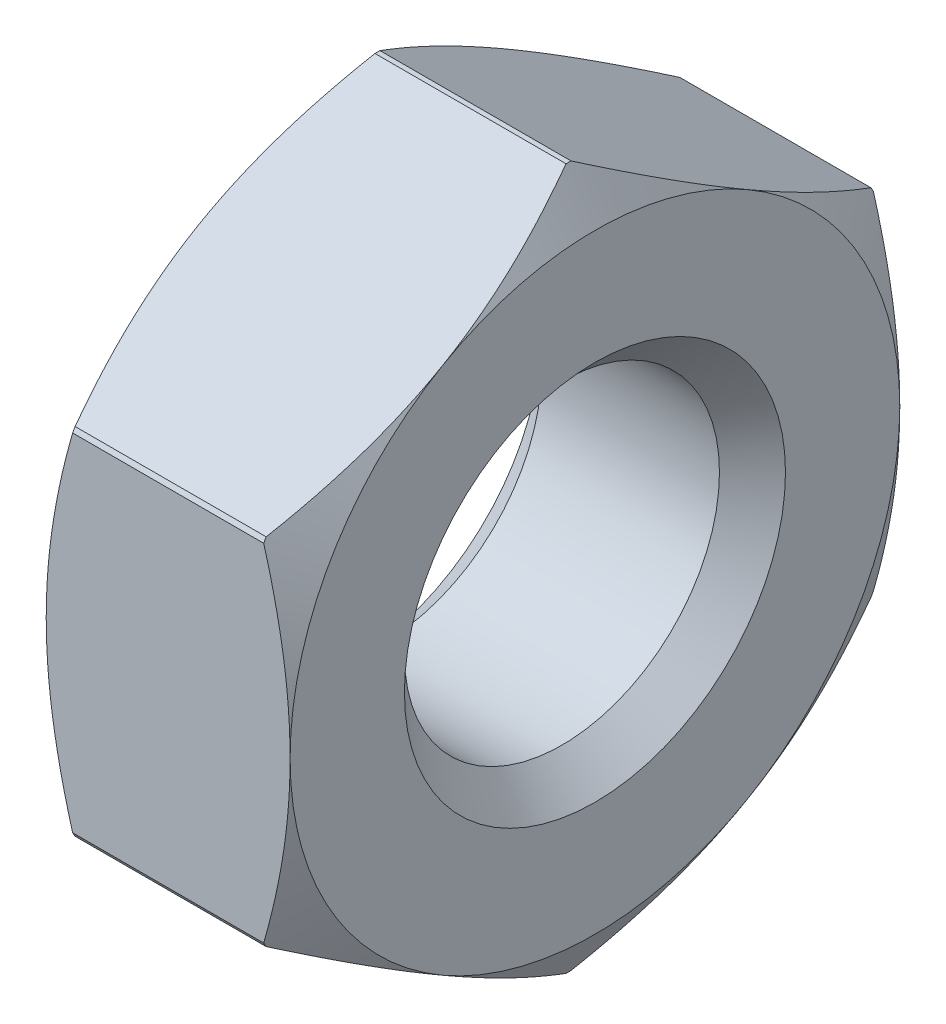
ISO-10303-21;
HEADER;
FILE_DESCRIPTION(('STEP AP214'),'2;1');
FILE_NAME('part.step','',(''),(''),'','','');
FILE_SCHEMA(('AUTOMOTIVE_DESIGN { 1 0 10303 214 1 1 1 1 }'));
ENDSEC;
DATA;
#1=APPLICATION_CONTEXT('core data for automotive mechanical design processes');
#2=APPLICATION_PROTOCOL_DEFINITION('international standard','automotive_design',2000,#1);
#3=PRODUCT_CONTEXT('',#1,'mechanical');
#4=PRODUCT('Part','Part','',(#3));
#5=PRODUCT_RELATED_PRODUCT_CATEGORY('part','',(#4));
#6=PRODUCT_DEFINITION_FORMATION('','',#4);
#7=PRODUCT_DEFINITION_CONTEXT('part definition',#1,'design');
#8=PRODUCT_DEFINITION('design','',#6,#7);
#9=PRODUCT_DEFINITION_SHAPE('','',#8);
#10=(LENGTH_UNIT() NAMED_UNIT(*) SI_UNIT(.MILLI.,.METRE.));
#11=(NAMED_UNIT(*) PLANE_ANGLE_UNIT() SI_UNIT($,.RADIAN.));
#12=(NAMED_UNIT(*) SI_UNIT($,.STERADIAN.) SOLID_ANGLE_UNIT());
#13=UNCERTAINTY_MEASURE_WITH_UNIT(LENGTH_MEASURE(1.E-05),#10,'distance_accuracy_value','');
#14=(GEOMETRIC_REPRESENTATION_CONTEXT(3) GLOBAL_UNCERTAINTY_ASSIGNED_CONTEXT((#13)) GLOBAL_UNIT_ASSIGNED_CONTEXT((#10,
#11,#12)) REPRESENTATION_CONTEXT('',''));
#15=CARTESIAN_POINT('',(0.,0.,0.));
#16=DIRECTION('',(0.,0.,1.));
#17=DIRECTION('',(1.,0.,0.));
#18=AXIS2_PLACEMENT_3D('',#15,#16,#17);
#19=CARTESIAN_POINT('',(-1.2535898384862,0.,0.));
#20=DIRECTION('',(1.,0.,0.));
#21=DIRECTION('',(0.,0.,-1.));
#22=AXIS2_PLACEMENT_3D('',#19,#20,#21);
#23=CONICAL_SURFACE('',#22,4.6,1.04719755119657);
#24=CARTESIAN_POINT('',(-1.2535898384862,0.,0.));
#25=DIRECTION('',(-1.,0.,0.));
#26=DIRECTION('',(0.,0.,1.));
#27=AXIS2_PLACEMENT_3D('',#24,#25,#26);
#28=CIRCLE('',#27,4.6);
#29=CARTESIAN_POINT('',(-1.2535898384862,2.27156333832011,4.));
#30=VERTEX_POINT('',#29);
#31=CARTESIAN_POINT('',(-1.2535898384862,2.3283199459777,3.9672315572906));
#32=VERTEX_POINT('',#31);
#33=EDGE_CURVE('E202',#30,#32,#28,.T.);
#34=ORIENTED_EDGE('',*,*,#33,.T.);
#35=CARTESIAN_POINT('',(-1.25338983848586,2.3279692402039,3.96783899750933));
#36=CARTESIAN_POINT('',(-1.31111735178797,2.429142168566,3.79260234523563));
#37=CARTESIAN_POINT('',(-1.36348279320894,2.53118892113824,3.61585218503312));
#38=CARTESIAN_POINT('',(-1.45457678399727,2.73702346022027,3.25933630539051));
#39=CARTESIAN_POINT('',(-1.49327364982772,2.84081471509825,3.07956457856053));
#40=CARTESIAN_POINT('',(-1.55308656588261,3.04712010513636,2.7222331611392));
#41=CARTESIAN_POINT('',(-1.57460784973854,3.14960377752827,2.54472623361016));
#42=CARTESIAN_POINT('',(-1.59956691269278,3.35501620732428,2.18894146869729));
#43=CARTESIAN_POINT('',(-1.60302614264184,3.45794429140324,2.01066479754682));
#44=CARTESIAN_POINT('',(-1.59246081058806,3.64780018158342,1.68182474963853));
#45=CARTESIAN_POINT('',(-1.58102948312847,3.73476734919332,1.53119319674782));
#46=CARTESIAN_POINT('',(-1.54582191519359,3.90813961339712,1.23090362652359));
#47=CARTESIAN_POINT('',(-1.52203530397381,3.99454417596539,1.08124653414958));
#48=CARTESIAN_POINT('',(-1.46297404311056,4.1682311172389,0.780411927252627));
#49=CARTESIAN_POINT('',(-1.42746612573347,4.25549316232234,0.629269631595747));
#50=CARTESIAN_POINT('',(-1.34703381000279,4.428767771581,0.3291492046981));
#51=CARTESIAN_POINT('',(-1.30212651130191,4.51478230551585,0.180167661733586));
#52=CARTESIAN_POINT('',(-1.2534092243396,4.6002,0.0322198750216415));
#53=B_SPLINE_CURVE_WITH_KNOTS('',3,(#35,#36,#37,#38,#39,#40,#41,#42,#43,#44,#45,#46,#47,#48,#49,
#50,#51,#52),.UNSPECIFIED.,.F.,.F.,(4,2,2,2,2,2,2,2,4),(0.,0.631503736039108,1.26446182692029,
1.88200396002549,2.49881252084838,3.02127973311479,3.54418620287518,4.07819884832956,
4.61124831605183),.UNSPECIFIED.);
#54=CARTESIAN_POINT('',(-1.6,3.46410161513775,2.));
#55=VERTEX_POINT('',#54);
#56=EDGE_CURVE('E326',#32,#55,#53,.T.);
#57=ORIENTED_EDGE('',*,*,#56,.T.);
#58=CARTESIAN_POINT('',(-1.6,0.,0.));
#59=DIRECTION('',(-1.,0.,0.));
#60=DIRECTION('',(0.,0.,1.));
#61=AXIS2_PLACEMENT_3D('',#58,#59,#60);
#62=CIRCLE('',#61,4.);
#63=CARTESIAN_POINT('',(-1.6,0.,4.));
#64=VERTEX_POINT('',#63);
#65=EDGE_CURVE('E197',#64,#55,#62,.T.);
#66=ORIENTED_EDGE('',*,*,#65,.F.);
#67=CARTESIAN_POINT('',(0.313379078741315,-6.1233664535977,4.));
#68=CARTESIAN_POINT('',(0.228520444207372,-5.94775555210065,4.));
#69=CARTESIAN_POINT('',(0.14450583630976,-5.77172927793175,4.));
#70=CARTESIAN_POINT('',(-0.0213529852084576,-5.41862138471516,4.));
#71=CARTESIAN_POINT('',(-0.103196822694453,-5.24153958920135,4.));
#72=CARTESIAN_POINT('',(-0.264663248796663,-4.88513872870433,4.));
#73=CARTESIAN_POINT('',(-0.344270431676537,-4.70581265888233,4.));
#74=CARTESIAN_POINT('',(-0.500063305946178,-4.34568605973509,4.));
#75=CARTESIAN_POINT('',(-0.576249175810661,-4.16488560790455,4.));
#76=CARTESIAN_POINT('',(-0.725191190367983,-3.79928520033142,4.));
#77=CARTESIAN_POINT('',(-0.797893952066102,-3.61446337687946,4.));
#78=CARTESIAN_POINT('',(-0.937601649527753,-3.24263920484199,4.));
#79=CARTESIAN_POINT('',(-1.00460595118251,-3.05563661621294,4.));
#80=CARTESIAN_POINT('',(-1.13111524111974,-2.67953798881603,4.));
#81=CARTESIAN_POINT('',(-1.19063618601766,-2.49044737285613,4.));
#82=CARTESIAN_POINT('',(-1.30024474002198,-2.10957804366364,4.));
#83=CARTESIAN_POINT('',(-1.35033533382433,-1.91780020165196,4.));
#84=CARTESIAN_POINT('',(-1.43865061155497,-1.53142481889712,4.));
#85=CARTESIAN_POINT('',(-1.47687205590236,-1.33682652347865,4.));
#86=CARTESIAN_POINT('',(-1.5388743003406,-0.945285434361876,4.));
#87=CARTESIAN_POINT('',(-1.56265508599781,-0.748342638320415,4.));
#88=CARTESIAN_POINT('',(-1.59367220542207,-0.354389260897205,4.));
#89=CARTESIAN_POINT('',(-1.60101312112597,-0.157387127838942,4.));
#90=CARTESIAN_POINT('',(-1.59876117115889,0.236476698325858,4.));
#91=CARTESIAN_POINT('',(-1.58917269339217,0.433338414597014,4.));
#92=CARTESIAN_POINT('',(-1.55901327204393,0.769555733364206,4.));
#93=CARTESIAN_POINT('',(-1.54235959607666,0.909282368357053,4.));
#94=CARTESIAN_POINT('',(-1.50160756903169,1.18765527874236,4.));
#95=CARTESIAN_POINT('',(-1.47750804257503,1.32630138001999,4.));
#96=CARTESIAN_POINT('',(-1.39530560781012,1.74050640575306,4.));
#97=CARTESIAN_POINT('',(-1.32732004295461,2.01412264026251,4.));
#98=CARTESIAN_POINT('',(-1.21007611546408,2.42354479344988,4.));
#99=CARTESIAN_POINT('',(-1.16785336132348,2.56148513959008,4.));
#100=CARTESIAN_POINT('',(-1.07923308673662,2.83592606637809,4.));
#101=CARTESIAN_POINT('',(-1.03283844697141,2.97242756888127,4.));
#102=CARTESIAN_POINT('',(-0.936839537899242,3.24341998247051,4.));
#103=CARTESIAN_POINT('',(-0.887254810051087,3.37791788659785,4.));
#104=CARTESIAN_POINT('',(-0.785177071056811,3.6458704440832,4.));
#105=CARTESIAN_POINT('',(-0.732682883212017,3.77932465005986,4.));
#106=CARTESIAN_POINT('',(-0.679021142388919,3.91229645619189,4.));
#107=B_SPLINE_CURVE_WITH_KNOTS('',3,(#67,#68,#69,#70,#71,#72,#73,#74,#75,#76,#77,#78,#79,#80,
#81,#82,#83,#84,#85,#86,#87,#88,#89,#90,#91,#92,#93,#94,#95,#96,#97,#98,#99,#100,#101,#102,#103,
#104,#105,#106),.UNSPECIFIED.,.F.,.F.,(4,2,2,2,2,2,2,2,2,2,2,2,2,2,2,2,2,2,2,4),(0.,
0.585124594132892,1.17034992050025,1.75892688540866,2.34747311111829,2.94322193926471,
3.53903697417808,4.13355920436511,4.72789295140857,5.32238877437791,5.91688519155342,
6.50758885642441,7.09813944016759,7.52008013875713,7.94208747766234,8.78673076285676,
9.21946972878956,9.65191215053146,10.0819198428512,10.5121027343793),.UNSPECIFIED.);
#108=EDGE_CURVE('E267',#64,#30,#107,.T.);
#109=ORIENTED_EDGE('',*,*,#108,.T.);
#110=EDGE_LOOP('',(#34,#57,#66,#109));
#111=FACE_BOUND('',#110,.T.);
#112=ADVANCED_FACE('F31',(#111),#23,.T.);
#113=CARTESIAN_POINT('',(-1.2535898384862,-2.3283199459777,3.9672315572906));
#114=VERTEX_POINT('',#113);
#115=CARTESIAN_POINT('',(-1.2535898384862,-2.27156333832011,4.));
#116=VERTEX_POINT('',#115);
#117=EDGE_CURVE('E330',#114,#116,#28,.T.);
#118=ORIENTED_EDGE('',*,*,#117,.T.);
#119=EDGE_CURVE('E275',#116,#64,#107,.T.);
#120=ORIENTED_EDGE('',*,*,#119,.T.);
#121=CARTESIAN_POINT('',(-1.6,-3.46410161513775,2.));
#122=VERTEX_POINT('',#121);
#123=EDGE_CURVE('E199',#122,#64,#62,.T.);
#124=ORIENTED_EDGE('',*,*,#123,.F.);
#125=CARTESIAN_POINT('',(-1.2534092243396,-4.6002,0.0322198750216419));
#126=CARTESIAN_POINT('',(-1.31113513524419,-4.49902761515883,0.207455585889462));
#127=CARTESIAN_POINT('',(-1.36349887129164,-4.39698141014375,0.384204797695172));
#128=CARTESIAN_POINT('',(-1.45458931866139,-4.19114802077275,0.740718685979847));
#129=CARTESIAN_POINT('',(-1.49328434835822,-4.0873573683737,0.920489369285726));
#130=CARTESIAN_POINT('',(-1.55309361407995,-3.88105320756823,1.27781865761365));
#131=CARTESIAN_POINT('',(-1.57461308026609,-3.77857016001243,1.4553245028948));
#132=CARTESIAN_POINT('',(-1.59956864459734,-3.57315905408983,1.81110697479165));
#133=CARTESIAN_POINT('',(-1.60302619245385,-3.47023166892176,1.98938243539296));
#134=CARTESIAN_POINT('',(-1.59245796307569,-3.28037581092052,2.3182224275657));
#135=CARTESIAN_POINT('',(-1.58102517746005,-3.19340797030735,2.46885514613226));
#136=CARTESIAN_POINT('',(-1.54581462012315,-3.02003441169075,2.76914695834524));
#137=CARTESIAN_POINT('',(-1.52202647740764,-2.93362922776767,2.91880512693733));
#138=CARTESIAN_POINT('',(-1.46296213616868,-2.75994105654835,3.21964186416292));
#139=CARTESIAN_POINT('',(-1.42745266840009,-2.67267840391389,3.37078521212904));
#140=CARTESIAN_POINT('',(-1.34701732333292,-2.49940261277033,3.67090768611138));
#141=CARTESIAN_POINT('',(-1.30210854622023,-2.41338750437934,3.81989022406313));
#142=CARTESIAN_POINT('',(-1.25338983848586,-2.3279692402039,3.96783899750933));
#143=B_SPLINE_CURVE_WITH_KNOTS('',3,(#125,#126,#127,#128,#129,#130,#131,#132,#133,#134,#135,
#136,#137,#138,#139,#140,#141,#142),.UNSPECIFIED.,.F.,.F.,(4,2,2,2,2,2,2,2,4),(0.,
0.631499273935331,1.26445279196895,1.88199062592049,2.49879492624227,3.0212664480065,
3.54417723891331,4.0781943887806,4.61124831603214),.UNSPECIFIED.);
#144=EDGE_CURVE('E259',#122,#114,#143,.T.);
#145=ORIENTED_EDGE('',*,*,#144,.T.);
#146=EDGE_LOOP('',(#118,#120,#124,#145));
#147=FACE_BOUND('',#146,.T.);
#148=ADVANCED_FACE('F316',(#147),#23,.T.);
#149=CARTESIAN_POINT('',(-1.2535898384862,-4.59988328429781,-0.0327684427093903));
#150=VERTEX_POINT('',#149);
#151=CARTESIAN_POINT('',(-1.2535898384862,-4.59988328429781,0.0327684427093903));
#152=VERTEX_POINT('',#151);
#153=EDGE_CURVE('E334',#150,#152,#28,.T.);
#154=ORIENTED_EDGE('',*,*,#153,.T.);
#155=EDGE_CURVE('E401',#152,#122,#143,.T.);
#156=ORIENTED_EDGE('',*,*,#155,.T.);
#157=CARTESIAN_POINT('',(-1.6,-3.46410161513775,-2.));
#158=VERTEX_POINT('',#157);
#159=EDGE_CURVE('E331',#158,#122,#62,.T.);
#160=ORIENTED_EDGE('',*,*,#159,.F.);
#161=CARTESIAN_POINT('',(-1.25338983848586,-2.3279692402039,-3.96783899750933));
#162=CARTESIAN_POINT('',(-1.31111735178797,-2.429142168566,-3.79260234523563));
#163=CARTESIAN_POINT('',(-1.36348279320894,-2.53118892113824,-3.61585218503312));
#164=CARTESIAN_POINT('',(-1.45457678399727,-2.73702346022027,-3.25933630539051));
#165=CARTESIAN_POINT('',(-1.49327364982772,-2.84081471509825,-3.07956457856053));
#166=CARTESIAN_POINT('',(-1.55308656588261,-3.04712010513636,-2.7222331611392));
#167=CARTESIAN_POINT('',(-1.57460784973854,-3.14960377752827,-2.54472623361016));
#168=CARTESIAN_POINT('',(-1.59956691269278,-3.35501620732428,-2.18894146869729));
#169=CARTESIAN_POINT('',(-1.60302614264184,-3.45794429140324,-2.01066479754682));
#170=CARTESIAN_POINT('',(-1.59246081058806,-3.64780018158342,-1.68182474963853));
#171=CARTESIAN_POINT('',(-1.58102948312847,-3.73476734919332,-1.53119319674782));
#172=CARTESIAN_POINT('',(-1.54582191519359,-3.90813961339712,-1.23090362652359));
#173=CARTESIAN_POINT('',(-1.52203530397381,-3.99454417596539,-1.08124653414958));
#174=CARTESIAN_POINT('',(-1.46297404311056,-4.1682311172389,-0.780411927252627));
#175=CARTESIAN_POINT('',(-1.42746612573347,-4.25549316232234,-0.629269631595747));
#176=CARTESIAN_POINT('',(-1.34703381000279,-4.428767771581,-0.3291492046981));
#177=CARTESIAN_POINT('',(-1.30212651130191,-4.51478230551585,-0.180167661733586));
#178=CARTESIAN_POINT('',(-1.2534092243396,-4.6002,-0.0322198750216415));
#179=B_SPLINE_CURVE_WITH_KNOTS('',3,(#161,#162,#163,#164,#165,#166,#167,#168,#169,#170,#171,
#172,#173,#174,#175,#176,#177,#178),.UNSPECIFIED.,.F.,.F.,(4,2,2,2,2,2,2,2,4),(0.,
0.631503736039108,1.26446182692029,1.88200396002549,2.49881252084838,3.02127973311479,
3.54418620287518,4.07819884832956,4.61124831605183),.UNSPECIFIED.);
#180=EDGE_CURVE('E252',#158,#150,#179,.T.);
#181=ORIENTED_EDGE('',*,*,#180,.T.);
#182=EDGE_LOOP('',(#154,#156,#160,#181));
#183=FACE_BOUND('',#182,.T.);
#184=ADVANCED_FACE('F321',(#183),#23,.T.);
#185=CARTESIAN_POINT('',(-1.2535898384862,-2.27156333832011,-4.));
#186=VERTEX_POINT('',#185);
#187=CARTESIAN_POINT('',(-1.2535898384862,-2.3283199459777,-3.9672315572906));
#188=VERTEX_POINT('',#187);
#189=EDGE_CURVE('E340',#186,#188,#28,.T.);
#190=ORIENTED_EDGE('',*,*,#189,.T.);
#191=EDGE_CURVE('E405',#188,#158,#179,.T.);
#192=ORIENTED_EDGE('',*,*,#191,.T.);
#193=CARTESIAN_POINT('',(-1.6,0.,-4.));
#194=VERTEX_POINT('',#193);
#195=EDGE_CURVE('E192',#194,#158,#62,.T.);
#196=ORIENTED_EDGE('',*,*,#195,.F.);
#197=CARTESIAN_POINT('',(0.313379078741315,-6.1233664535977,-4.));
#198=CARTESIAN_POINT('',(0.228520444207372,-5.94775555210065,-4.));
#199=CARTESIAN_POINT('',(0.14450583630976,-5.77172927793175,-4.));
#200=CARTESIAN_POINT('',(-0.0213529852084576,-5.41862138471516,-4.));
#201=CARTESIAN_POINT('',(-0.103196822694453,-5.24153958920135,-4.));
#202=CARTESIAN_POINT('',(-0.264663248796663,-4.88513872870433,-4.));
#203=CARTESIAN_POINT('',(-0.344270431676537,-4.70581265888233,-4.));
#204=CARTESIAN_POINT('',(-0.500063305946178,-4.34568605973509,-4.));
#205=CARTESIAN_POINT('',(-0.576249175810661,-4.16488560790455,-4.));
#206=CARTESIAN_POINT('',(-0.725191190367983,-3.79928520033142,-4.));
#207=CARTESIAN_POINT('',(-0.797893952066102,-3.61446337687946,-4.));
#208=CARTESIAN_POINT('',(-0.937601649527753,-3.24263920484199,-4.));
#209=CARTESIAN_POINT('',(-1.00460595118251,-3.05563661621294,-4.));
#210=CARTESIAN_POINT('',(-1.13111524111974,-2.67953798881603,-4.));
#211=CARTESIAN_POINT('',(-1.19063618601766,-2.49044737285613,-4.));
#212=CARTESIAN_POINT('',(-1.30024474002198,-2.10957804366364,-4.));
#213=CARTESIAN_POINT('',(-1.35033533382433,-1.91780020165196,-4.));
#214=CARTESIAN_POINT('',(-1.43865061155497,-1.53142481889712,-4.));
#215=CARTESIAN_POINT('',(-1.47687205590236,-1.33682652347865,-4.));
#216=CARTESIAN_POINT('',(-1.5388743003406,-0.945285434361876,-4.));
#217=CARTESIAN_POINT('',(-1.56265508599781,-0.748342638320415,-4.));
#218=CARTESIAN_POINT('',(-1.59367220542207,-0.354389260897205,-4.));
#219=CARTESIAN_POINT('',(-1.60101312112597,-0.157387127838942,-4.));
#220=CARTESIAN_POINT('',(-1.59876117115889,0.236476698325858,-4.));
#221=CARTESIAN_POINT('',(-1.58917269339217,0.433338414597014,-4.));
#222=CARTESIAN_POINT('',(-1.55901327204393,0.769555733364206,-4.));
#223=CARTESIAN_POINT('',(-1.54235959607666,0.909282368357053,-4.));
#224=CARTESIAN_POINT('',(-1.50160756903169,1.18765527874236,-4.));
#225=CARTESIAN_POINT('',(-1.47750804257503,1.32630138001999,-4.));
#226=CARTESIAN_POINT('',(-1.39530560781012,1.74050640575306,-4.));
#227=CARTESIAN_POINT('',(-1.32732004295461,2.01412264026251,-4.));
#228=CARTESIAN_POINT('',(-1.21007611546408,2.42354479344988,-4.));
#229=CARTESIAN_POINT('',(-1.16785336132348,2.56148513959008,-4.));
#230=CARTESIAN_POINT('',(-1.07923308673662,2.83592606637809,-4.));
#231=CARTESIAN_POINT('',(-1.03283844697141,2.97242756888127,-4.));
#232=CARTESIAN_POINT('',(-0.936839537899242,3.24341998247051,-4.));
#233=CARTESIAN_POINT('',(-0.887254810051087,3.37791788659785,-4.));
#234=CARTESIAN_POINT('',(-0.785177071056811,3.6458704440832,-4.));
#235=CARTESIAN_POINT('',(-0.732682883212017,3.77932465005986,-4.));
#236=CARTESIAN_POINT('',(-0.679021142388919,3.91229645619189,-4.));
#237=B_SPLINE_CURVE_WITH_KNOTS('',3,(#197,#198,#199,#200,#201,#202,#203,#204,#205,#206,#207,
#208,#209,#210,#211,#212,#213,#214,#215,#216,#217,#218,#219,#220,#221,#222,#223,#224,#225,#226,
#227,#228,#229,#230,#231,#232,#233,#234,#235,#236),.UNSPECIFIED.,.F.,.F.,(4,2,2,2,2,2,2,2,2,2,2,
2,2,2,2,2,2,2,2,4),(0.,0.585124594132892,1.17034992050025,1.75892688540866,2.34747311111829,
2.94322193926471,3.53903697417808,4.13355920436511,4.72789295140857,5.32238877437791,
5.91688519155342,6.50758885642441,7.09813944016759,7.52008013875713,7.94208747766234,
8.78673076285676,9.21946972878956,9.65191215053146,10.0819198428512,10.5121027343793),.UNSPECIFIED.);
#238=EDGE_CURVE('E245',#194,#186,#237,.F.);
#239=ORIENTED_EDGE('',*,*,#238,.T.);
#240=EDGE_LOOP('',(#190,#192,#196,#239));
#241=FACE_BOUND('',#240,.T.);
#242=ADVANCED_FACE('F458',(#241),#23,.T.);
#243=CARTESIAN_POINT('',(-1.2535898384862,2.3283199459777,-3.9672315572906));
#244=VERTEX_POINT('',#243);
#245=CARTESIAN_POINT('',(-1.2535898384862,2.27156333832011,-4.));
#246=VERTEX_POINT('',#245);
#247=EDGE_CURVE('E332',#244,#246,#28,.T.);
#248=ORIENTED_EDGE('',*,*,#247,.T.);
#249=EDGE_CURVE('E188',#246,#194,#237,.F.);
#250=ORIENTED_EDGE('',*,*,#249,.T.);
#251=CARTESIAN_POINT('',(-1.6,3.46410161513775,-2.));
#252=VERTEX_POINT('',#251);
#253=EDGE_CURVE('E186',#252,#194,#62,.T.);
#254=ORIENTED_EDGE('',*,*,#253,.F.);
#255=CARTESIAN_POINT('',(-1.2534092243396,4.6002,-0.0322198750216419));
#256=CARTESIAN_POINT('',(-1.31113513524419,4.49902761515883,-0.207455585889462));
#257=CARTESIAN_POINT('',(-1.36349887129164,4.39698141014375,-0.384204797695172));
#258=CARTESIAN_POINT('',(-1.45458931866139,4.19114802077275,-0.740718685979847));
#259=CARTESIAN_POINT('',(-1.49328434835822,4.0873573683737,-0.920489369285726));
#260=CARTESIAN_POINT('',(-1.55309361407995,3.88105320756823,-1.27781865761365));
#261=CARTESIAN_POINT('',(-1.57461308026609,3.77857016001243,-1.4553245028948));
#262=CARTESIAN_POINT('',(-1.59956864459734,3.57315905408983,-1.81110697479165));
#263=CARTESIAN_POINT('',(-1.60302619245385,3.47023166892176,-1.98938243539296));
#264=CARTESIAN_POINT('',(-1.59245796307569,3.28037581092052,-2.3182224275657));
#265=CARTESIAN_POINT('',(-1.58102517746005,3.19340797030735,-2.46885514613226));
#266=CARTESIAN_POINT('',(-1.54581462012315,3.02003441169075,-2.76914695834524));
#267=CARTESIAN_POINT('',(-1.52202647740764,2.93362922776767,-2.91880512693733));
#268=CARTESIAN_POINT('',(-1.46296213616868,2.75994105654835,-3.21964186416292));
#269=CARTESIAN_POINT('',(-1.42745266840009,2.67267840391389,-3.37078521212904));
#270=CARTESIAN_POINT('',(-1.34701732333292,2.49940261277033,-3.67090768611138));
#271=CARTESIAN_POINT('',(-1.30210854622023,2.41338750437934,-3.81989022406313));
#272=CARTESIAN_POINT('',(-1.25338983848586,2.3279692402039,-3.96783899750933));
#273=B_SPLINE_CURVE_WITH_KNOTS('',3,(#255,#256,#257,#258,#259,#260,#261,#262,#263,#264,#265,
#266,#267,#268,#269,#270,#271,#272),.UNSPECIFIED.,.F.,.F.,(4,2,2,2,2,2,2,2,4),(0.,
0.631499273935331,1.26445279196895,1.88199062592049,2.49879492624227,3.0212664480065,
3.54417723891331,4.0781943887806,4.61124831603214),.UNSPECIFIED.);
#274=EDGE_CURVE('E160',#252,#244,#273,.T.);
#275=ORIENTED_EDGE('',*,*,#274,.T.);
#276=EDGE_LOOP('',(#248,#250,#254,#275));
#277=FACE_BOUND('',#276,.T.);
#278=ADVANCED_FACE('F187',(#277),#23,.T.);
#279=CARTESIAN_POINT('',(1.6,0.,0.));
#280=DIRECTION('',(-1.,0.,0.));
#281=DIRECTION('',(0.,0.,1.));
#282=AXIS2_PLACEMENT_3D('',#279,#280,#281);
#283=CYLINDRICAL_SURFACE('',#282,4.6);
#284=CARTESIAN_POINT('',(1.2535898384862,0.,0.));
#285=DIRECTION('',(-1.,0.,0.));
#286=DIRECTION('',(0.,0.,1.));
#287=AXIS2_PLACEMENT_3D('',#284,#285,#286);
#288=CIRCLE('',#287,4.6);
#289=CARTESIAN_POINT('',(1.2535898384862,2.27156333832011,4.));
#290=VERTEX_POINT('',#289);
#291=CARTESIAN_POINT('',(1.2535898384862,2.3283199459777,3.9672315572906));
#292=VERTEX_POINT('',#291);
#293=EDGE_CURVE('E335',#290,#292,#288,.T.);
#294=ORIENTED_EDGE('',*,*,#293,.T.);
#295=DIRECTION('',(-1.,0.,0.));
#296=VECTOR('',#295,1.);
#297=CARTESIAN_POINT('',(1.6,2.3283199459777,3.9672315572906));
#298=LINE('',#297,#296);
#299=EDGE_CURVE('E390',#292,#32,#298,.T.);
#300=ORIENTED_EDGE('',*,*,#299,.T.);
#301=ORIENTED_EDGE('',*,*,#33,.F.);
#302=DIRECTION('',(-1.,0.,0.));
#303=VECTOR('',#302,1.);
#304=CARTESIAN_POINT('',(1.6,2.27156333832011,4.));
#305=LINE('',#304,#303);
#306=EDGE_CURVE('E402',#30,#290,#305,.F.);
#307=ORIENTED_EDGE('',*,*,#306,.T.);
#308=EDGE_LOOP('',(#294,#300,#301,#307));
#309=FACE_BOUND('',#308,.T.);
#310=ADVANCED_FACE('F451',(#309),#283,.T.);
#311=CARTESIAN_POINT('',(1.2535898384862,-2.3283199459777,3.9672315572906));
#312=VERTEX_POINT('',#311);
#313=CARTESIAN_POINT('',(1.2535898384862,-2.27156333832011,4.));
#314=VERTEX_POINT('',#313);
#315=EDGE_CURVE('E343',#312,#314,#288,.T.);
#316=ORIENTED_EDGE('',*,*,#315,.T.);
#317=DIRECTION('',(-1.,0.,0.));
#318=VECTOR('',#317,1.);
#319=CARTESIAN_POINT('',(1.6,-2.27156333832011,4.));
#320=LINE('',#319,#318);
#321=EDGE_CURVE('E51',#314,#116,#320,.T.);
#322=ORIENTED_EDGE('',*,*,#321,.T.);
#323=ORIENTED_EDGE('',*,*,#117,.F.);
#324=DIRECTION('',(-1.,0.,0.));
#325=VECTOR('',#324,1.);
#326=CARTESIAN_POINT('',(1.6,-2.3283199459777,3.9672315572906));
#327=LINE('',#326,#325);
#328=EDGE_CURVE('E403',#114,#312,#327,.F.);
#329=ORIENTED_EDGE('',*,*,#328,.T.);
#330=EDGE_LOOP('',(#316,#322,#323,#329));
#331=FACE_BOUND('',#330,.T.);
#332=ADVANCED_FACE('F446',(#331),#283,.T.);
#333=CARTESIAN_POINT('',(1.2535898384862,-4.59988328429781,-0.0327684427093902));
#334=VERTEX_POINT('',#333);
#335=CARTESIAN_POINT('',(1.2535898384862,-4.59988328429781,0.0327684427093903));
#336=VERTEX_POINT('',#335);
#337=EDGE_CURVE('E349',#334,#336,#288,.T.);
#338=ORIENTED_EDGE('',*,*,#337,.T.);
#339=DIRECTION('',(-1.,0.,0.));
#340=VECTOR('',#339,1.);
#341=CARTESIAN_POINT('',(1.6,-4.59988328429781,0.0327684427093903));
#342=LINE('',#341,#340);
#343=EDGE_CURVE('E59',#336,#152,#342,.T.);
#344=ORIENTED_EDGE('',*,*,#343,.T.);
#345=ORIENTED_EDGE('',*,*,#153,.F.);
#346=DIRECTION('',(-1.,0.,0.));
#347=VECTOR('',#346,1.);
#348=CARTESIAN_POINT('',(1.6,-4.59988328429781,-0.0327684427093903));
#349=LINE('',#348,#347);
#350=EDGE_CURVE('E411',#150,#334,#349,.F.);
#351=ORIENTED_EDGE('',*,*,#350,.T.);
#352=EDGE_LOOP('',(#338,#344,#345,#351));
#353=FACE_BOUND('',#352,.T.);
#354=ADVANCED_FACE('F444',(#353),#283,.T.);
#355=CARTESIAN_POINT('',(1.25358983848685,-2.27156333832106,-4.));
#356=VERTEX_POINT('',#355);
#357=CARTESIAN_POINT('',(1.2535898384862,-2.3283199459777,-3.9672315572906));
#358=VERTEX_POINT('',#357);
#359=EDGE_CURVE('E355',#356,#358,#288,.T.);
#360=ORIENTED_EDGE('',*,*,#359,.T.);
#361=DIRECTION('',(-1.,0.,0.));
#362=VECTOR('',#361,1.);
#363=CARTESIAN_POINT('',(1.6,-2.3283199459777,-3.9672315572906));
#364=LINE('',#363,#362);
#365=EDGE_CURVE('E409',#358,#188,#364,.T.);
#366=ORIENTED_EDGE('',*,*,#365,.T.);
#367=ORIENTED_EDGE('',*,*,#189,.F.);
#368=DIRECTION('',(-1.,0.,0.));
#369=VECTOR('',#368,1.);
#370=CARTESIAN_POINT('',(1.6,-2.27156333832011,-4.));
#371=LINE('',#370,#369);
#372=EDGE_CURVE('E183',#186,#356,#371,.F.);
#373=ORIENTED_EDGE('',*,*,#372,.T.);
#374=EDGE_LOOP('',(#360,#366,#367,#373));
#375=FACE_BOUND('',#374,.T.);
#376=ADVANCED_FACE('F424',(#375),#283,.T.);
#377=CARTESIAN_POINT('',(1.2535898384862,2.3283199459777,-3.9672315572906));
#378=VERTEX_POINT('',#377);
#379=CARTESIAN_POINT('',(1.2535898384862,2.27156333832011,-4.));
#380=VERTEX_POINT('',#379);
#381=EDGE_CURVE('E346',#378,#380,#288,.T.);
#382=ORIENTED_EDGE('',*,*,#381,.T.);
#383=DIRECTION('',(-1.,0.,0.));
#384=VECTOR('',#383,1.);
#385=CARTESIAN_POINT('',(1.6,2.27156333832011,-4.));
#386=LINE('',#385,#384);
#387=EDGE_CURVE('E418',#380,#246,#386,.T.);
#388=ORIENTED_EDGE('',*,*,#387,.T.);
#389=ORIENTED_EDGE('',*,*,#247,.F.);
#390=DIRECTION('',(-1.,0.,0.));
#391=VECTOR('',#390,1.);
#392=CARTESIAN_POINT('',(1.6,2.3283199459777,-3.9672315572906));
#393=LINE('',#392,#391);
#394=EDGE_CURVE('E166',#244,#378,#393,.F.);
#395=ORIENTED_EDGE('',*,*,#394,.T.);
#396=EDGE_LOOP('',(#382,#388,#389,#395));
#397=FACE_BOUND('',#396,.T.);
#398=ADVANCED_FACE('F431',(#397),#283,.T.);
#399=CARTESIAN_POINT('',(1.6,0.,0.));
#400=DIRECTION('',(-1.,0.,0.));
#401=DIRECTION('',(0.,0.,1.));
#402=AXIS2_PLACEMENT_3D('',#399,#400,#401);
#403=CONICAL_SURFACE('',#402,4.,1.04719755119657);
#404=CARTESIAN_POINT('',(1.2535898384862,4.59988328429781,0.0327684427093902));
#405=VERTEX_POINT('',#404);
#406=CARTESIAN_POINT('',(1.2535898384862,4.59988328429781,-0.0327684427093903));
#407=VERTEX_POINT('',#406);
#408=EDGE_CURVE('E342',#405,#407,#288,.T.);
#409=ORIENTED_EDGE('',*,*,#408,.F.);
#410=CARTESIAN_POINT('',(1.2534092243396,4.6002,0.0322198750216413));
#411=CARTESIAN_POINT('',(1.31113513524419,4.49902761515883,0.207455585889462));
#412=CARTESIAN_POINT('',(1.36349887129164,4.39698141014375,0.384204797695171));
#413=CARTESIAN_POINT('',(1.45458931866138,4.19114802077275,0.740718685979846));
#414=CARTESIAN_POINT('',(1.49328434835822,4.0873573683737,0.920489369285725));
#415=CARTESIAN_POINT('',(1.55309361407995,3.88105320756823,1.27781865761365));
#416=CARTESIAN_POINT('',(1.57461308026609,3.77857016001243,1.4553245028948));
#417=CARTESIAN_POINT('',(1.59956864459734,3.57315905408984,1.81110697479165));
#418=CARTESIAN_POINT('',(1.60302619245385,3.47023166892176,1.98938243539296));
#419=CARTESIAN_POINT('',(1.59245796307569,3.28037581092052,2.3182224275657));
#420=CARTESIAN_POINT('',(1.58102517746005,3.19340797030735,2.46885514613226));
#421=CARTESIAN_POINT('',(1.54581462012315,3.02003441169075,2.76914695834523));
#422=CARTESIAN_POINT('',(1.52202647740764,2.93362922776768,2.91880512693733));
#423=CARTESIAN_POINT('',(1.46296213616868,2.75994105654835,3.21964186416292));
#424=CARTESIAN_POINT('',(1.42745266840009,2.67267840391389,3.37078521212904));
#425=CARTESIAN_POINT('',(1.34701732333292,2.49940261277033,3.67090768611138));
#426=CARTESIAN_POINT('',(1.30210854622023,2.41338750437934,3.81989022406313));
#427=CARTESIAN_POINT('',(1.25338983848586,2.3279692402039,3.96783899750933));
#428=B_SPLINE_CURVE_WITH_KNOTS('',3,(#410,#411,#412,#413,#414,#415,#416,#417,#418,#419,#420,
#421,#422,#423,#424,#425,#426,#427),.UNSPECIFIED.,.F.,.F.,(4,2,2,2,2,2,2,2,4),(0.,
0.63149927393533,1.26445279196895,1.88199062592049,2.49879492624227,3.0212664480065,
3.5441772389133,4.0781943887806,4.61124831603214),.UNSPECIFIED.);
#429=CARTESIAN_POINT('',(1.6,3.46410161513775,2.));
#430=VERTEX_POINT('',#429);
#431=EDGE_CURVE('E11',#405,#430,#428,.T.);
#432=ORIENTED_EDGE('',*,*,#431,.T.);
#433=CARTESIAN_POINT('',(1.6,0.,0.));
#434=DIRECTION('',(-1.,0.,0.));
#435=DIRECTION('',(0.,0.,1.));
#436=AXIS2_PLACEMENT_3D('',#433,#434,#435);
#437=CIRCLE('',#436,4.);
#438=CARTESIAN_POINT('',(1.6,3.46410161513775,-2.));
#439=VERTEX_POINT('',#438);
#440=EDGE_CURVE('E357',#430,#439,#437,.T.);
#441=ORIENTED_EDGE('',*,*,#440,.T.);
#442=CARTESIAN_POINT('',(1.25338983848586,2.3279692402039,-3.96783899750933));
#443=CARTESIAN_POINT('',(1.31111735178797,2.429142168566,-3.79260234523563));
#444=CARTESIAN_POINT('',(1.36348279320894,2.53118892113823,-3.61585218503312));
#445=CARTESIAN_POINT('',(1.45457678399727,2.73702346022027,-3.25933630539051));
#446=CARTESIAN_POINT('',(1.49327364982772,2.84081471509825,-3.07956457856053));
#447=CARTESIAN_POINT('',(1.55308656588261,3.04712010513636,-2.7222331611392));
#448=CARTESIAN_POINT('',(1.57460784973854,3.14960377752827,-2.54472623361016));
#449=CARTESIAN_POINT('',(1.59956691269278,3.35501620732428,-2.18894146869729));
#450=CARTESIAN_POINT('',(1.60302614264184,3.45794429140324,-2.01066479754682));
#451=CARTESIAN_POINT('',(1.59246081058806,3.64780018158342,-1.68182474963853));
#452=CARTESIAN_POINT('',(1.58102948312847,3.73476734919332,-1.53119319674782));
#453=CARTESIAN_POINT('',(1.54582191519359,3.90813961339712,-1.23090362652359));
#454=CARTESIAN_POINT('',(1.52203530397381,3.99454417596539,-1.08124653414959));
#455=CARTESIAN_POINT('',(1.46297404311056,4.1682311172389,-0.780411927252628));
#456=CARTESIAN_POINT('',(1.42746612573347,4.25549316232234,-0.629269631595748));
#457=CARTESIAN_POINT('',(1.34703381000279,4.428767771581,-0.3291492046981));
#458=CARTESIAN_POINT('',(1.30212651130191,4.51478230551585,-0.180167661733587));
#459=CARTESIAN_POINT('',(1.2534092243396,4.6002,-0.0322198750216418));
#460=B_SPLINE_CURVE_WITH_KNOTS('',3,(#442,#443,#444,#445,#446,#447,#448,#449,#450,#451,#452,
#453,#454,#455,#456,#457,#458,#459),.UNSPECIFIED.,.F.,.F.,(4,2,2,2,2,2,2,2,4),(0.,
0.631503736039108,1.26446182692029,1.88200396002549,2.49881252084838,3.02127973311479,
3.54418620287518,4.07819884832956,4.61124831605183),.UNSPECIFIED.);
#461=EDGE_CURVE('E198',#439,#407,#460,.T.);
#462=ORIENTED_EDGE('',*,*,#461,.T.);
#463=EDGE_LOOP('',(#409,#432,#441,#462));
#464=FACE_BOUND('',#463,.T.);
#465=ADVANCED_FACE('F464',(#464),#403,.T.);
#466=CARTESIAN_POINT('',(1.6,0.,4.));
#467=VERTEX_POINT('',#466);
#468=EDGE_CURVE('E350',#467,#430,#437,.T.);
#469=ORIENTED_EDGE('',*,*,#468,.T.);
#470=EDGE_CURVE('E35',#430,#292,#428,.T.);
#471=ORIENTED_EDGE('',*,*,#470,.T.);
#472=ORIENTED_EDGE('',*,*,#293,.F.);
#473=CARTESIAN_POINT('',(-0.313379078741314,-6.1233664535977,4.));
#474=CARTESIAN_POINT('',(-0.228520444207372,-5.94775555210065,4.));
#475=CARTESIAN_POINT('',(-0.14450583630976,-5.77172927793175,4.));
#476=CARTESIAN_POINT('',(0.0213529852084581,-5.41862138471516,4.));
#477=CARTESIAN_POINT('',(0.103196822694454,-5.24153958920135,4.));
#478=CARTESIAN_POINT('',(0.264663248796664,-4.88513872870433,4.));
#479=CARTESIAN_POINT('',(0.344270431676538,-4.70581265888233,4.));
#480=CARTESIAN_POINT('',(0.50006330594618,-4.34568605973509,4.));
#481=CARTESIAN_POINT('',(0.576249175810662,-4.16488560790455,4.));
#482=CARTESIAN_POINT('',(0.725191190367985,-3.79928520033142,4.));
#483=CARTESIAN_POINT('',(0.797893952066103,-3.61446337687946,4.));
#484=CARTESIAN_POINT('',(0.937601649527754,-3.24263920484199,4.));
#485=CARTESIAN_POINT('',(1.00460595118251,-3.05563661621294,4.));
#486=CARTESIAN_POINT('',(1.13111524111974,-2.67953798881603,4.));
#487=CARTESIAN_POINT('',(1.19063618601766,-2.49044737285613,4.));
#488=CARTESIAN_POINT('',(1.30024474002198,-2.10957804366363,4.));
#489=CARTESIAN_POINT('',(1.35033533382433,-1.91780020165196,4.));
#490=CARTESIAN_POINT('',(1.43865061155497,-1.53142481889712,4.));
#491=CARTESIAN_POINT('',(1.47687205590236,-1.33682652347865,4.));
#492=CARTESIAN_POINT('',(1.5388743003406,-0.945285434361876,4.));
#493=CARTESIAN_POINT('',(1.56265508599781,-0.748342638320416,4.));
#494=CARTESIAN_POINT('',(1.59367220542207,-0.354389260897206,4.));
#495=CARTESIAN_POINT('',(1.60101312112597,-0.157387127838943,4.));
#496=CARTESIAN_POINT('',(1.59876117115889,0.236476698325857,4.));
#497=CARTESIAN_POINT('',(1.58917269339217,0.433338414597013,4.));
#498=CARTESIAN_POINT('',(1.55901327204393,0.769555733364205,4.));
#499=CARTESIAN_POINT('',(1.54235959607666,0.909282368357053,4.));
#500=CARTESIAN_POINT('',(1.50160756903169,1.18765527874235,4.));
#501=CARTESIAN_POINT('',(1.47750804257503,1.32630138001999,4.));
#502=CARTESIAN_POINT('',(1.39530560781012,1.74050640575306,4.));
#503=CARTESIAN_POINT('',(1.32732004295461,2.01412264026252,4.));
#504=CARTESIAN_POINT('',(1.21007611546408,2.42354479344988,4.));
#505=CARTESIAN_POINT('',(1.16785336132348,2.56148513959008,4.));
#506=CARTESIAN_POINT('',(1.07923308673662,2.83592606637809,4.));
#507=CARTESIAN_POINT('',(1.03283844697141,2.97242756888127,4.));
#508=CARTESIAN_POINT('',(0.936839537899242,3.24341998247051,4.));
#509=CARTESIAN_POINT('',(0.887254810051088,3.37791788659785,4.));
#510=CARTESIAN_POINT('',(0.785177071056811,3.6458704440832,4.));
#511=CARTESIAN_POINT('',(0.732682883212018,3.77932465005986,4.));
#512=CARTESIAN_POINT('',(0.679021142388919,3.91229645619189,4.));
#513=B_SPLINE_CURVE_WITH_KNOTS('',3,(#473,#474,#475,#476,#477,#478,#479,#480,#481,#482,#483,
#484,#485,#486,#487,#488,#489,#490,#491,#492,#493,#494,#495,#496,#497,#498,#499,#500,#501,#502,
#503,#504,#505,#506,#507,#508,#509,#510,#511,#512),.UNSPECIFIED.,.F.,.F.,(4,2,2,2,2,2,2,2,2,2,2,
2,2,2,2,2,2,2,2,4),(0.,0.585124594132892,1.17034992050025,1.75892688540867,2.3474731111183,
2.94322193926471,3.53903697417808,4.13355920436511,4.72789295140857,5.32238877437791,
5.91688519155342,6.50758885642441,7.09813944016759,7.52008013875713,7.94208747766234,
8.78673076285676,9.21946972878956,9.65191215053146,10.0819198428512,10.5121027343793),.UNSPECIFIED.);
#514=EDGE_CURVE('E292',#290,#467,#513,.F.);
#515=ORIENTED_EDGE('',*,*,#514,.T.);
#516=EDGE_LOOP('',(#469,#471,#472,#515));
#517=FACE_BOUND('',#516,.T.);
#518=ADVANCED_FACE('F469',(#517),#403,.T.);
#519=CARTESIAN_POINT('',(1.6,-3.46410161513775,2.));
#520=VERTEX_POINT('',#519);
#521=EDGE_CURVE('E358',#520,#467,#437,.T.);
#522=ORIENTED_EDGE('',*,*,#521,.T.);
#523=EDGE_CURVE('E287',#467,#314,#513,.F.);
#524=ORIENTED_EDGE('',*,*,#523,.T.);
#525=ORIENTED_EDGE('',*,*,#315,.F.);
#526=CARTESIAN_POINT('',(1.25338983848586,-2.3279692402039,3.96783899750933));
#527=CARTESIAN_POINT('',(1.31111735178797,-2.429142168566,3.79260234523563));
#528=CARTESIAN_POINT('',(1.36348279320894,-2.53118892113823,3.61585218503312));
#529=CARTESIAN_POINT('',(1.45457678399727,-2.73702346022027,3.25933630539051));
#530=CARTESIAN_POINT('',(1.49327364982772,-2.84081471509825,3.07956457856053));
#531=CARTESIAN_POINT('',(1.55308656588261,-3.04712010513636,2.7222331611392));
#532=CARTESIAN_POINT('',(1.57460784973854,-3.14960377752827,2.54472623361016));
#533=CARTESIAN_POINT('',(1.59956691269278,-3.35501620732428,2.18894146869729));
#534=CARTESIAN_POINT('',(1.60302614264184,-3.45794429140324,2.01066479754682));
#535=CARTESIAN_POINT('',(1.59246081058806,-3.64780018158342,1.68182474963853));
#536=CARTESIAN_POINT('',(1.58102948312847,-3.73476734919332,1.53119319674782));
#537=CARTESIAN_POINT('',(1.54582191519359,-3.90813961339712,1.23090362652359));
#538=CARTESIAN_POINT('',(1.52203530397381,-3.99454417596539,1.08124653414959));
#539=CARTESIAN_POINT('',(1.46297404311056,-4.1682311172389,0.780411927252628));
#540=CARTESIAN_POINT('',(1.42746612573347,-4.25549316232234,0.629269631595748));
#541=CARTESIAN_POINT('',(1.34703381000279,-4.428767771581,0.3291492046981));
#542=CARTESIAN_POINT('',(1.30212651130191,-4.51478230551585,0.180167661733587));
#543=CARTESIAN_POINT('',(1.2534092243396,-4.6002,0.0322198750216418));
#544=B_SPLINE_CURVE_WITH_KNOTS('',3,(#526,#527,#528,#529,#530,#531,#532,#533,#534,#535,#536,
#537,#538,#539,#540,#541,#542,#543),.UNSPECIFIED.,.F.,.F.,(4,2,2,2,2,2,2,2,4),(0.,
0.631503736039108,1.26446182692029,1.88200396002549,2.49881252084838,3.02127973311479,
3.54418620287518,4.07819884832956,4.61124831605183),.UNSPECIFIED.);
#545=EDGE_CURVE('E293',#312,#520,#544,.T.);
#546=ORIENTED_EDGE('',*,*,#545,.T.);
#547=EDGE_LOOP('',(#522,#524,#525,#546));
#548=FACE_BOUND('',#547,.T.);
#549=ADVANCED_FACE('F474',(#548),#403,.T.);
#550=CARTESIAN_POINT('',(1.6,-3.46410161513775,-2.));
#551=VERTEX_POINT('',#550);
#552=EDGE_CURVE('E367',#551,#520,#437,.T.);
#553=ORIENTED_EDGE('',*,*,#552,.T.);
#554=EDGE_CURVE('E294',#520,#336,#544,.T.);
#555=ORIENTED_EDGE('',*,*,#554,.T.);
#556=ORIENTED_EDGE('',*,*,#337,.F.);
#557=CARTESIAN_POINT('',(1.2534092243396,-4.6002,-0.0322198750216413));
#558=CARTESIAN_POINT('',(1.31113513524419,-4.49902761515883,-0.207455585889462));
#559=CARTESIAN_POINT('',(1.36349887129164,-4.39698141014375,-0.384204797695171));
#560=CARTESIAN_POINT('',(1.45458931866138,-4.19114802077275,-0.740718685979846));
#561=CARTESIAN_POINT('',(1.49328434835822,-4.0873573683737,-0.920489369285725));
#562=CARTESIAN_POINT('',(1.55309361407995,-3.88105320756823,-1.27781865761365));
#563=CARTESIAN_POINT('',(1.57461308026609,-3.77857016001243,-1.4553245028948));
#564=CARTESIAN_POINT('',(1.59956864459734,-3.57315905408984,-1.81110697479165));
#565=CARTESIAN_POINT('',(1.60302619245385,-3.47023166892176,-1.98938243539296));
#566=CARTESIAN_POINT('',(1.59245796307569,-3.28037581092052,-2.3182224275657));
#567=CARTESIAN_POINT('',(1.58102517746005,-3.19340797030735,-2.46885514613226));
#568=CARTESIAN_POINT('',(1.54581462012315,-3.02003441169075,-2.76914695834523));
#569=CARTESIAN_POINT('',(1.52202647740764,-2.93362922776768,-2.91880512693733));
#570=CARTESIAN_POINT('',(1.46296213616868,-2.75994105654835,-3.21964186416292));
#571=CARTESIAN_POINT('',(1.42745266840009,-2.67267840391389,-3.37078521212904));
#572=CARTESIAN_POINT('',(1.34701732333292,-2.49940261277033,-3.67090768611138));
#573=CARTESIAN_POINT('',(1.30210854622023,-2.41338750437934,-3.81989022406313));
#574=CARTESIAN_POINT('',(1.25338983848586,-2.3279692402039,-3.96783899750933));
#575=B_SPLINE_CURVE_WITH_KNOTS('',3,(#557,#558,#559,#560,#561,#562,#563,#564,#565,#566,#567,
#568,#569,#570,#571,#572,#573,#574),.UNSPECIFIED.,.F.,.F.,(4,2,2,2,2,2,2,2,4),(0.,
0.63149927393533,1.26445279196895,1.88199062592049,2.49879492624227,3.0212664480065,
3.5441772389133,4.0781943887806,4.61124831603214),.UNSPECIFIED.);
#576=EDGE_CURVE('E298',#334,#551,#575,.T.);
#577=ORIENTED_EDGE('',*,*,#576,.T.);
#578=EDGE_LOOP('',(#553,#555,#556,#577));
#579=FACE_BOUND('',#578,.T.);
#580=ADVANCED_FACE('F443',(#579),#403,.T.);
#581=CARTESIAN_POINT('',(1.6,0.,-4.));
#582=VERTEX_POINT('',#581);
#583=EDGE_CURVE('E373',#582,#551,#437,.T.);
#584=ORIENTED_EDGE('',*,*,#583,.T.);
#585=EDGE_CURVE('E299',#551,#358,#575,.T.);
#586=ORIENTED_EDGE('',*,*,#585,.T.);
#587=ORIENTED_EDGE('',*,*,#359,.F.);
#588=CARTESIAN_POINT('',(-0.313379078741314,-6.1233664535977,-4.));
#589=CARTESIAN_POINT('',(-0.228520444207372,-5.94775555210065,-4.));
#590=CARTESIAN_POINT('',(-0.14450583630976,-5.77172927793175,-4.));
#591=CARTESIAN_POINT('',(0.0213529852084581,-5.41862138471516,-4.));
#592=CARTESIAN_POINT('',(0.103196822694454,-5.24153958920135,-4.));
#593=CARTESIAN_POINT('',(0.264663248796664,-4.88513872870433,-4.));
#594=CARTESIAN_POINT('',(0.344270431676538,-4.70581265888233,-4.));
#595=CARTESIAN_POINT('',(0.50006330594618,-4.34568605973509,-4.));
#596=CARTESIAN_POINT('',(0.576249175810662,-4.16488560790455,-4.));
#597=CARTESIAN_POINT('',(0.725191190367985,-3.79928520033142,-4.));
#598=CARTESIAN_POINT('',(0.797893952066103,-3.61446337687946,-4.));
#599=CARTESIAN_POINT('',(0.937601649527754,-3.24263920484199,-4.));
#600=CARTESIAN_POINT('',(1.00460595118251,-3.05563661621294,-4.));
#601=CARTESIAN_POINT('',(1.13111524111974,-2.67953798881603,-4.));
#602=CARTESIAN_POINT('',(1.19063618601766,-2.49044737285613,-4.));
#603=CARTESIAN_POINT('',(1.30024474002198,-2.10957804366363,-4.));
#604=CARTESIAN_POINT('',(1.35033533382433,-1.91780020165196,-4.));
#605=CARTESIAN_POINT('',(1.43865061155497,-1.53142481889712,-4.));
#606=CARTESIAN_POINT('',(1.47687205590236,-1.33682652347865,-4.));
#607=CARTESIAN_POINT('',(1.5388743003406,-0.945285434361876,-4.));
#608=CARTESIAN_POINT('',(1.56265508599781,-0.748342638320416,-4.));
#609=CARTESIAN_POINT('',(1.59367220542207,-0.354389260897206,-4.));
#610=CARTESIAN_POINT('',(1.60101312112597,-0.157387127838943,-4.));
#611=CARTESIAN_POINT('',(1.59876117115889,0.236476698325857,-4.));
#612=CARTESIAN_POINT('',(1.58917269339217,0.433338414597013,-4.));
#613=CARTESIAN_POINT('',(1.55901327204393,0.769555733364205,-4.));
#614=CARTESIAN_POINT('',(1.54235959607666,0.909282368357053,-4.));
#615=CARTESIAN_POINT('',(1.50160756903169,1.18765527874235,-4.));
#616=CARTESIAN_POINT('',(1.47750804257503,1.32630138001999,-4.));
#617=CARTESIAN_POINT('',(1.39530560781012,1.74050640575306,-4.));
#618=CARTESIAN_POINT('',(1.32732004295461,2.01412264026252,-4.));
#619=CARTESIAN_POINT('',(1.21007611546408,2.42354479344988,-4.));
#620=CARTESIAN_POINT('',(1.16785336132348,2.56148513959008,-4.));
#621=CARTESIAN_POINT('',(1.07923308673662,2.83592606637809,-4.));
#622=CARTESIAN_POINT('',(1.03283844697141,2.97242756888127,-4.));
#623=CARTESIAN_POINT('',(0.936839537899242,3.24341998247051,-4.));
#624=CARTESIAN_POINT('',(0.887254810051088,3.37791788659785,-4.));
#625=CARTESIAN_POINT('',(0.785177071056811,3.6458704440832,-4.));
#626=CARTESIAN_POINT('',(0.732682883212018,3.77932465005986,-4.));
#627=CARTESIAN_POINT('',(0.679021142388919,3.91229645619189,-4.));
#628=B_SPLINE_CURVE_WITH_KNOTS('',3,(#588,#589,#590,#591,#592,#593,#594,#595,#596,#597,#598,
#599,#600,#601,#602,#603,#604,#605,#606,#607,#608,#609,#610,#611,#612,#613,#614,#615,#616,#617,
#618,#619,#620,#621,#622,#623,#624,#625,#626,#627),.UNSPECIFIED.,.F.,.F.,(4,2,2,2,2,2,2,2,2,2,2,
2,2,2,2,2,2,2,2,4),(0.,0.585124594132892,1.17034992050025,1.75892688540867,2.3474731111183,
2.94322193926471,3.53903697417808,4.13355920436511,4.72789295140857,5.32238877437791,
5.91688519155342,6.50758885642441,7.09813944016759,7.52008013875713,7.94208747766234,
8.78673076285676,9.21946972878956,9.65191215053146,10.0819198428512,10.5121027343793),.UNSPECIFIED.);
#629=EDGE_CURVE('E304',#356,#582,#628,.T.);
#630=ORIENTED_EDGE('',*,*,#629,.T.);
#631=EDGE_LOOP('',(#584,#586,#587,#630));
#632=FACE_BOUND('',#631,.T.);
#633=ADVANCED_FACE('F428',(#632),#403,.T.);
#634=CARTESIAN_POINT('',(-1.6,0.,0.));
#635=DIRECTION('',(1.,0.,0.));
#636=DIRECTION('',(0.,0.,-1.));
#637=AXIS2_PLACEMENT_3D('',#634,#635,#636);
#638=PLANE('',#637);
#639=ORIENTED_EDGE('',*,*,#65,.T.);
#640=EDGE_CURVE('E179',#55,#252,#62,.T.);
#641=ORIENTED_EDGE('',*,*,#640,.T.);
#642=ORIENTED_EDGE('',*,*,#253,.T.);
#643=ORIENTED_EDGE('',*,*,#195,.T.);
#644=ORIENTED_EDGE('',*,*,#159,.T.);
#645=ORIENTED_EDGE('',*,*,#123,.T.);
#646=EDGE_LOOP('',(#639,#641,#642,#643,#644,#645));
#647=FACE_BOUND('',#646,.T.);
#648=CARTESIAN_POINT('',(-1.6,0.,0.));
#649=DIRECTION('',(-1.,0.,0.));
#650=DIRECTION('',(0.,0.,1.));
#651=AXIS2_PLACEMENT_3D('',#648,#649,#650);
#652=CIRCLE('',#651,2.5);
#653=CARTESIAN_POINT('',(-1.6,0.,2.5));
#654=VERTEX_POINT('',#653);
#655=EDGE_CURVE('E368',#654,#654,#652,.T.);
#656=ORIENTED_EDGE('',*,*,#655,.F.);
#657=EDGE_LOOP('',(#656));
#658=FACE_BOUND('',#657,.T.);
#659=ADVANCED_FACE('F33',(#647,#658),#638,.F.);
#660=CARTESIAN_POINT('',(1.6,4.,0.));
#661=DIRECTION('',(-1.,0.,0.));
#662=DIRECTION('',(0.,0.,1.));
#663=AXIS2_PLACEMENT_3D('',#660,#661,#662);
#664=PLANE('',#663);
#665=ORIENTED_EDGE('',*,*,#468,.F.);
#666=ORIENTED_EDGE('',*,*,#521,.F.);
#667=ORIENTED_EDGE('',*,*,#552,.F.);
#668=ORIENTED_EDGE('',*,*,#583,.F.);
#669=EDGE_CURVE('E364',#439,#582,#437,.T.);
#670=ORIENTED_EDGE('',*,*,#669,.F.);
#671=ORIENTED_EDGE('',*,*,#440,.F.);
#672=EDGE_LOOP('',(#665,#666,#667,#668,#670,#671));
#673=FACE_BOUND('',#672,.T.);
#674=CARTESIAN_POINT('',(1.6,0.,0.));
#675=DIRECTION('',(-1.,0.,0.));
#676=DIRECTION('',(0.,0.,1.));
#677=AXIS2_PLACEMENT_3D('',#674,#675,#676);
#678=CIRCLE('',#677,2.5);
#679=CARTESIAN_POINT('',(1.6,0.,2.5));
#680=VERTEX_POINT('',#679);
#681=EDGE_CURVE('E384',#680,#680,#678,.T.);
#682=ORIENTED_EDGE('',*,*,#681,.T.);
#683=EDGE_LOOP('',(#682));
#684=FACE_BOUND('',#683,.T.);
#685=ADVANCED_FACE('F238',(#673,#684),#664,.F.);
#686=ORIENTED_EDGE('',*,*,#640,.F.);
#687=CARTESIAN_POINT('',(-1.2535898384862,4.59988328429781,0.0327684427093903));
#688=VERTEX_POINT('',#687);
#689=EDGE_CURVE('E386',#55,#688,#53,.T.);
#690=ORIENTED_EDGE('',*,*,#689,.T.);
#691=CARTESIAN_POINT('',(-1.2535898384862,4.59988328429781,-0.0327684427093903));
#692=VERTEX_POINT('',#691);
#693=EDGE_CURVE('E182',#688,#692,#28,.T.);
#694=ORIENTED_EDGE('',*,*,#693,.T.);
#695=EDGE_CURVE('E163',#692,#252,#273,.T.);
#696=ORIENTED_EDGE('',*,*,#695,.T.);
#697=EDGE_LOOP('',(#686,#690,#694,#696));
#698=FACE_BOUND('',#697,.T.);
#699=ADVANCED_FACE('F176',(#698),#23,.T.);
#700=ORIENTED_EDGE('',*,*,#693,.F.);
#701=DIRECTION('',(-1.,0.,0.));
#702=VECTOR('',#701,1.);
#703=CARTESIAN_POINT('',(1.6,4.59988328429781,0.0327684427093903));
#704=LINE('',#703,#702);
#705=EDGE_CURVE('E276',#688,#405,#704,.F.);
#706=ORIENTED_EDGE('',*,*,#705,.T.);
#707=ORIENTED_EDGE('',*,*,#408,.T.);
#708=DIRECTION('',(-1.,0.,0.));
#709=VECTOR('',#708,1.);
#710=CARTESIAN_POINT('',(1.6,4.59988328429781,-0.0327684427093903));
#711=LINE('',#710,#709);
#712=EDGE_CURVE('E171',#407,#692,#711,.T.);
#713=ORIENTED_EDGE('',*,*,#712,.T.);
#714=EDGE_LOOP('',(#700,#706,#707,#713));
#715=FACE_BOUND('',#714,.T.);
#716=ADVANCED_FACE('F237',(#715),#283,.T.);
#717=ORIENTED_EDGE('',*,*,#669,.T.);
#718=EDGE_CURVE('E211',#582,#380,#628,.T.);
#719=ORIENTED_EDGE('',*,*,#718,.T.);
#720=ORIENTED_EDGE('',*,*,#381,.F.);
#721=EDGE_CURVE('E210',#378,#439,#460,.T.);
#722=ORIENTED_EDGE('',*,*,#721,.T.);
#723=EDGE_LOOP('',(#717,#719,#720,#722));
#724=FACE_BOUND('',#723,.T.);
#725=ADVANCED_FACE('F217',(#724),#403,.T.);
#726=CARTESIAN_POINT('',(-1.167,0.,0.));
#727=DIRECTION('',(-1.,0.,0.));
#728=DIRECTION('',(0.,0.,1.));
#729=AXIS2_PLACEMENT_3D('',#726,#727,#728);
#730=CONICAL_SURFACE('',#729,2.067,0.785398163397449);
#731=ORIENTED_EDGE('',*,*,#655,.T.);
#732=EDGE_LOOP('',(#731));
#733=FACE_BOUND('',#732,.T.);
#734=CARTESIAN_POINT('',(-1.167,0.,0.));
#735=DIRECTION('',(-1.,0.,0.));
#736=DIRECTION('',(0.,0.,1.));
#737=AXIS2_PLACEMENT_3D('',#734,#735,#736);
#738=CIRCLE('',#737,2.067);
#739=CARTESIAN_POINT('',(-1.167,0.,2.067));
#740=VERTEX_POINT('',#739);
#741=EDGE_CURVE('E375',#740,#740,#738,.T.);
#742=ORIENTED_EDGE('',*,*,#741,.F.);
#743=EDGE_LOOP('',(#742));
#744=FACE_BOUND('',#743,.T.);
#745=ADVANCED_FACE('F463',(#733,#744),#730,.F.);
#746=CARTESIAN_POINT('',(1.6,0.,0.));
#747=DIRECTION('',(-1.,0.,0.));
#748=DIRECTION('',(0.,0.,1.));
#749=AXIS2_PLACEMENT_3D('',#746,#747,#748);
#750=CYLINDRICAL_SURFACE('',#749,2.067);
#751=ORIENTED_EDGE('',*,*,#741,.T.);
#752=EDGE_LOOP('',(#751));
#753=FACE_BOUND('',#752,.T.);
#754=CARTESIAN_POINT('',(1.167,0.,0.));
#755=DIRECTION('',(-1.,0.,0.));
#756=DIRECTION('',(0.,0.,1.));
#757=AXIS2_PLACEMENT_3D('',#754,#755,#756);
#758=CIRCLE('',#757,2.067);
#759=CARTESIAN_POINT('',(1.167,0.,2.067));
#760=VERTEX_POINT('',#759);
#761=EDGE_CURVE('E379',#760,#760,#758,.T.);
#762=ORIENTED_EDGE('',*,*,#761,.F.);
#763=EDGE_LOOP('',(#762));
#764=FACE_BOUND('',#763,.T.);
#765=ADVANCED_FACE('F494',(#753,#764),#750,.F.);
#766=CARTESIAN_POINT('',(1.6,0.,0.));
#767=DIRECTION('',(1.,0.,0.));
#768=DIRECTION('',(0.,0.,-1.));
#769=AXIS2_PLACEMENT_3D('',#766,#767,#768);
#770=CONICAL_SURFACE('',#769,2.5,0.785398163397449);
#771=ORIENTED_EDGE('',*,*,#761,.T.);
#772=EDGE_LOOP('',(#771));
#773=FACE_BOUND('',#772,.T.);
#774=ORIENTED_EDGE('',*,*,#681,.F.);
#775=EDGE_LOOP('',(#774));
#776=FACE_BOUND('',#775,.T.);
#777=ADVANCED_FACE('F224',(#773,#776),#770,.F.);
#778=CARTESIAN_POINT('',(1.6,2.3094010767585,-4.));
#779=DIRECTION('',(0.,-0.866025403784439,0.5));
#780=DIRECTION('',(0.,-0.5,-0.866025403784439));
#781=AXIS2_PLACEMENT_3D('',#778,#779,#780);
#782=PLANE('',#781);
#783=ORIENTED_EDGE('',*,*,#712,.F.);
#784=ORIENTED_EDGE('',*,*,#461,.F.);
#785=ORIENTED_EDGE('',*,*,#721,.F.);
#786=ORIENTED_EDGE('',*,*,#394,.F.);
#787=ORIENTED_EDGE('',*,*,#274,.F.);
#788=ORIENTED_EDGE('',*,*,#695,.F.);
#789=EDGE_LOOP('',(#783,#784,#785,#786,#787,#788));
#790=FACE_BOUND('',#789,.T.);
#791=ADVANCED_FACE('F162',(#790),#782,.F.);
#792=CARTESIAN_POINT('',(1.6,-2.3094010767585,-4.));
#793=DIRECTION('',(0.,0.,1.));
#794=DIRECTION('',(1.,0.,0.));
#795=AXIS2_PLACEMENT_3D('',#792,#793,#794);
#796=PLANE('',#795);
#797=ORIENTED_EDGE('',*,*,#387,.F.);
#798=ORIENTED_EDGE('',*,*,#718,.F.);
#799=ORIENTED_EDGE('',*,*,#629,.F.);
#800=ORIENTED_EDGE('',*,*,#372,.F.);
#801=ORIENTED_EDGE('',*,*,#238,.F.);
#802=ORIENTED_EDGE('',*,*,#249,.F.);
#803=EDGE_LOOP('',(#797,#798,#799,#800,#801,#802));
#804=FACE_BOUND('',#803,.T.);
#805=ADVANCED_FACE('F223',(#804),#796,.F.);
#806=CARTESIAN_POINT('',(1.6,-4.618802153517,0.));
#807=DIRECTION('',(0.,0.866025403784439,0.5));
#808=DIRECTION('',(0.,-0.5,0.866025403784439));
#809=AXIS2_PLACEMENT_3D('',#806,#807,#808);
#810=PLANE('',#809);
#811=ORIENTED_EDGE('',*,*,#365,.F.);
#812=ORIENTED_EDGE('',*,*,#585,.F.);
#813=ORIENTED_EDGE('',*,*,#576,.F.);
#814=ORIENTED_EDGE('',*,*,#350,.F.);
#815=ORIENTED_EDGE('',*,*,#180,.F.);
#816=ORIENTED_EDGE('',*,*,#191,.F.);
#817=EDGE_LOOP('',(#811,#812,#813,#814,#815,#816));
#818=FACE_BOUND('',#817,.T.);
#819=ADVANCED_FACE('F305',(#818),#810,.F.);
#820=CARTESIAN_POINT('',(1.6,-2.3094010767585,4.));
#821=DIRECTION('',(0.,0.866025403784439,-0.5));
#822=DIRECTION('',(0.,0.5,0.866025403784439));
#823=AXIS2_PLACEMENT_3D('',#820,#821,#822);
#824=PLANE('',#823);
#825=ORIENTED_EDGE('',*,*,#343,.F.);
#826=ORIENTED_EDGE('',*,*,#554,.F.);
#827=ORIENTED_EDGE('',*,*,#545,.F.);
#828=ORIENTED_EDGE('',*,*,#328,.F.);
#829=ORIENTED_EDGE('',*,*,#144,.F.);
#830=ORIENTED_EDGE('',*,*,#155,.F.);
#831=EDGE_LOOP('',(#825,#826,#827,#828,#829,#830));
#832=FACE_BOUND('',#831,.T.);
#833=ADVANCED_FACE('F282',(#832),#824,.F.);
#834=CARTESIAN_POINT('',(1.6,2.3094010767585,4.));
#835=DIRECTION('',(0.,0.,-1.));
#836=DIRECTION('',(-1.,0.,0.));
#837=AXIS2_PLACEMENT_3D('',#834,#835,#836);
#838=PLANE('',#837);
#839=ORIENTED_EDGE('',*,*,#321,.F.);
#840=ORIENTED_EDGE('',*,*,#523,.F.);
#841=ORIENTED_EDGE('',*,*,#514,.F.);
#842=ORIENTED_EDGE('',*,*,#306,.F.);
#843=ORIENTED_EDGE('',*,*,#108,.F.);
#844=ORIENTED_EDGE('',*,*,#119,.F.);
#845=EDGE_LOOP('',(#839,#840,#841,#842,#843,#844));
#846=FACE_BOUND('',#845,.T.);
#847=ADVANCED_FACE('F278',(#846),#838,.F.);
#848=CARTESIAN_POINT('',(1.6,4.618802153517,0.));
#849=DIRECTION('',(0.,-0.866025403784439,-0.5));
#850=DIRECTION('',(0.,0.5,-0.866025403784439));
#851=AXIS2_PLACEMENT_3D('',#848,#849,#850);
#852=PLANE('',#851);
#853=ORIENTED_EDGE('',*,*,#299,.F.);
#854=ORIENTED_EDGE('',*,*,#470,.F.);
#855=ORIENTED_EDGE('',*,*,#431,.F.);
#856=ORIENTED_EDGE('',*,*,#705,.F.);
#857=ORIENTED_EDGE('',*,*,#689,.F.);
#858=ORIENTED_EDGE('',*,*,#56,.F.);
#859=EDGE_LOOP('',(#853,#854,#855,#856,#857,#858));
#860=FACE_BOUND('',#859,.T.);
#861=ADVANCED_FACE('F281',(#860),#852,.F.);
#862=CLOSED_SHELL('',(#112,#148,#184,#242,#278,#310,#332,#354,#376,#398,#465,#518,#549,#580,
#633,#659,#685,#699,#716,#725,#745,#765,#777,#791,#805,#819,#833,#847,#861));
#863=MANIFOLD_SOLID_BREP('B2',#862);
#864=ADVANCED_BREP_SHAPE_REPRESENTATION('',(#18,#863),#14);
#865=SHAPE_DEFINITION_REPRESENTATION(#9,#864);
ENDSEC;
END-ISO-10303-21;
